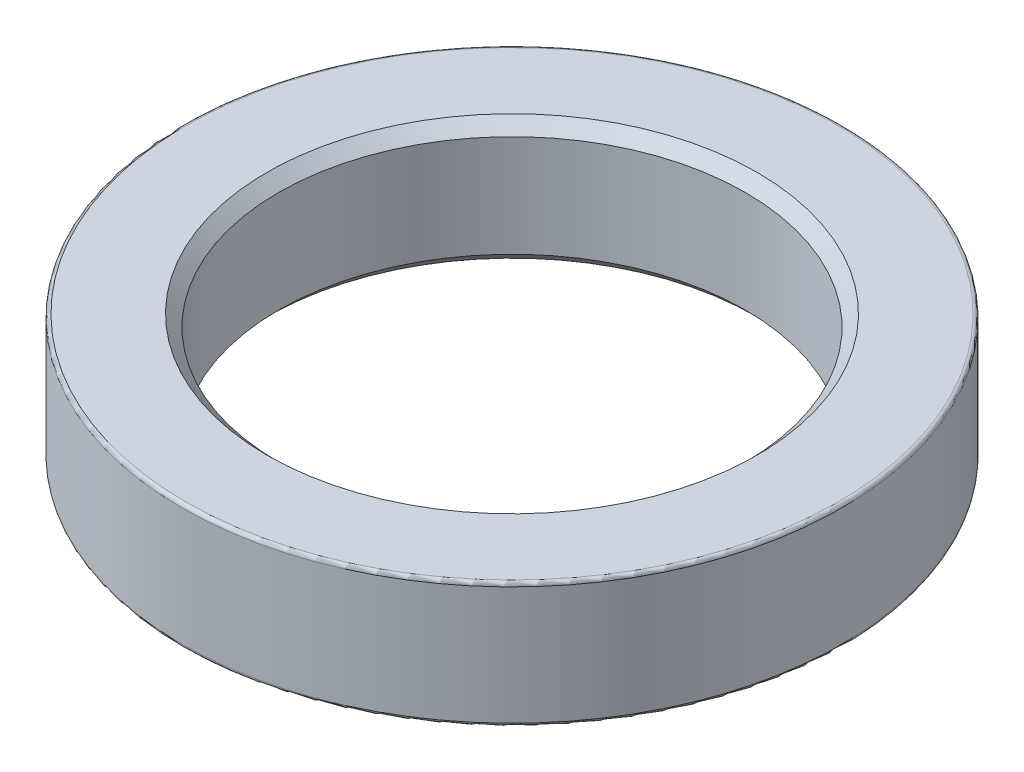
ISO-10303-21;
HEADER;
FILE_DESCRIPTION(('STEP AP214'),'2;1');
FILE_NAME('part.step','',(''),(''),'','','');
FILE_SCHEMA(('AUTOMOTIVE_DESIGN { 1 0 10303 214 1 1 1 1 }'));
ENDSEC;
DATA;
#1=APPLICATION_CONTEXT('core data for automotive mechanical design processes');
#2=APPLICATION_PROTOCOL_DEFINITION('international standard','automotive_design',2000,#1);
#3=PRODUCT_CONTEXT('',#1,'mechanical');
#4=PRODUCT('Part','Part','',(#3));
#5=PRODUCT_RELATED_PRODUCT_CATEGORY('part','',(#4));
#6=PRODUCT_DEFINITION_FORMATION('','',#4);
#7=PRODUCT_DEFINITION_CONTEXT('part definition',#1,'design');
#8=PRODUCT_DEFINITION('design','',#6,#7);
#9=PRODUCT_DEFINITION_SHAPE('','',#8);
#10=(LENGTH_UNIT() NAMED_UNIT(*) SI_UNIT(.MILLI.,.METRE.));
#11=(NAMED_UNIT(*) PLANE_ANGLE_UNIT() SI_UNIT($,.RADIAN.));
#12=(NAMED_UNIT(*) SI_UNIT($,.STERADIAN.) SOLID_ANGLE_UNIT());
#13=UNCERTAINTY_MEASURE_WITH_UNIT(LENGTH_MEASURE(1.E-05),#10,'distance_accuracy_value','');
#14=(GEOMETRIC_REPRESENTATION_CONTEXT(3) GLOBAL_UNCERTAINTY_ASSIGNED_CONTEXT((#13)) GLOBAL_UNIT_ASSIGNED_CONTEXT((#10,
#11,#12)) REPRESENTATION_CONTEXT('',''));
#15=CARTESIAN_POINT('',(0.,0.,0.));
#16=DIRECTION('',(0.,0.,1.));
#17=DIRECTION('',(1.,0.,0.));
#18=AXIS2_PLACEMENT_3D('',#15,#16,#17);
#19=CARTESIAN_POINT('',(0.,13.5128,0.));
#20=DIRECTION('',(0.,-1.,0.));
#21=DIRECTION('',(0.,0.,-1.));
#22=AXIS2_PLACEMENT_3D('',#19,#20,#21);
#23=CYLINDRICAL_SURFACE('',#22,35.5981);
#24=CARTESIAN_POINT('',(0.,0.380999999999999,0.));
#25=DIRECTION('',(0.,1.,0.));
#26=DIRECTION('',(0.,0.,1.));
#27=AXIS2_PLACEMENT_3D('',#24,#25,#26);
#28=CIRCLE('',#27,35.5981);
#29=CARTESIAN_POINT('',(0.,0.380999999999999,35.5981));
#30=VERTEX_POINT('',#29);
#31=EDGE_CURVE('E63',#30,#30,#28,.T.);
#32=ORIENTED_EDGE('',*,*,#31,.T.);
#33=EDGE_LOOP('',(#32));
#34=FACE_BOUND('',#33,.T.);
#35=CARTESIAN_POINT('',(0.,13.1318,0.));
#36=DIRECTION('',(0.,1.,0.));
#37=DIRECTION('',(0.,0.,1.));
#38=AXIS2_PLACEMENT_3D('',#35,#36,#37);
#39=CIRCLE('',#38,35.5981);
#40=CARTESIAN_POINT('',(0.,13.1318,35.5981));
#41=VERTEX_POINT('',#40);
#42=EDGE_CURVE('E66',#41,#41,#39,.F.);
#43=ORIENTED_EDGE('',*,*,#42,.T.);
#44=EDGE_LOOP('',(#43));
#45=FACE_BOUND('',#44,.T.);
#46=ADVANCED_FACE('F39',(#34,#45),#23,.T.);
#47=CARTESIAN_POINT('',(0.,13.5128,0.));
#48=DIRECTION('',(0.,1.,0.));
#49=DIRECTION('',(0.,0.,1.));
#50=AXIS2_PLACEMENT_3D('',#47,#48,#49);
#51=PLANE('',#50);
#52=CARTESIAN_POINT('',(0.,13.5128,0.));
#53=DIRECTION('',(0.,1.,0.));
#54=DIRECTION('',(0.,0.,1.));
#55=AXIS2_PLACEMENT_3D('',#52,#53,#54);
#56=CIRCLE('',#55,26.4668);
#57=CARTESIAN_POINT('',(0.,13.5128,26.4668));
#58=VERTEX_POINT('',#57);
#59=EDGE_CURVE('E51',#58,#58,#56,.F.);
#60=ORIENTED_EDGE('',*,*,#59,.T.);
#61=EDGE_LOOP('',(#60));
#62=FACE_BOUND('',#61,.T.);
#63=CARTESIAN_POINT('',(0.,13.5128,0.));
#64=DIRECTION('',(0.,1.,0.));
#65=DIRECTION('',(0.,0.,1.));
#66=AXIS2_PLACEMENT_3D('',#63,#64,#65);
#67=CIRCLE('',#66,35.2171);
#68=CARTESIAN_POINT('',(0.,13.5128,35.2171));
#69=VERTEX_POINT('',#68);
#70=EDGE_CURVE('E69',#69,#69,#67,.T.);
#71=ORIENTED_EDGE('',*,*,#70,.T.);
#72=EDGE_LOOP('',(#71));
#73=FACE_BOUND('',#72,.T.);
#74=ADVANCED_FACE('F73',(#62,#73),#51,.T.);
#75=CARTESIAN_POINT('',(0.,0.,0.));
#76=DIRECTION('',(0.,1.,0.));
#77=DIRECTION('',(0.,0.,1.));
#78=AXIS2_PLACEMENT_3D('',#75,#76,#77);
#79=PLANE('',#78);
#80=CARTESIAN_POINT('',(0.,0.,0.));
#81=DIRECTION('',(0.,1.,0.));
#82=DIRECTION('',(0.,0.,1.));
#83=AXIS2_PLACEMENT_3D('',#80,#81,#82);
#84=CIRCLE('',#83,26.4668);
#85=CARTESIAN_POINT('',(0.,0.,26.4668));
#86=VERTEX_POINT('',#85);
#87=EDGE_CURVE('E47',#86,#86,#84,.T.);
#88=ORIENTED_EDGE('',*,*,#87,.T.);
#89=EDGE_LOOP('',(#88));
#90=FACE_BOUND('',#89,.T.);
#91=CARTESIAN_POINT('',(0.,0.,0.));
#92=DIRECTION('',(0.,1.,0.));
#93=DIRECTION('',(0.,0.,1.));
#94=AXIS2_PLACEMENT_3D('',#91,#92,#93);
#95=CIRCLE('',#94,35.2171);
#96=CARTESIAN_POINT('',(0.,0.,35.2171));
#97=VERTEX_POINT('',#96);
#98=EDGE_CURVE('E60',#97,#97,#95,.F.);
#99=ORIENTED_EDGE('',*,*,#98,.T.);
#100=EDGE_LOOP('',(#99));
#101=FACE_BOUND('',#100,.T.);
#102=ADVANCED_FACE('F89',(#90,#101),#79,.F.);
#103=CARTESIAN_POINT('',(0.,-27.1272,0.));
#104=DIRECTION('',(0.,1.,0.));
#105=DIRECTION('',(0.,0.,1.));
#106=AXIS2_PLACEMENT_3D('',#103,#104,#105);
#107=CYLINDRICAL_SURFACE('',#106,25.2095);
#108=CARTESIAN_POINT('',(0.,1.25729999999998,0.));
#109=DIRECTION('',(0.,1.,0.));
#110=DIRECTION('',(0.,0.,1.));
#111=AXIS2_PLACEMENT_3D('',#108,#109,#110);
#112=CIRCLE('',#111,25.2095);
#113=CARTESIAN_POINT('',(0.,1.25729999999998,25.2095));
#114=VERTEX_POINT('',#113);
#115=EDGE_CURVE('E10',#114,#114,#112,.F.);
#116=ORIENTED_EDGE('',*,*,#115,.T.);
#117=EDGE_LOOP('',(#116));
#118=FACE_BOUND('',#117,.T.);
#119=CARTESIAN_POINT('',(0.,12.2555,0.));
#120=DIRECTION('',(0.,1.,0.));
#121=DIRECTION('',(0.,0.,1.));
#122=AXIS2_PLACEMENT_3D('',#119,#120,#121);
#123=CIRCLE('',#122,25.2095);
#124=CARTESIAN_POINT('',(0.,12.2555,25.2095));
#125=VERTEX_POINT('',#124);
#126=EDGE_CURVE('E55',#125,#125,#123,.T.);
#127=ORIENTED_EDGE('',*,*,#126,.T.);
#128=EDGE_LOOP('',(#127));
#129=FACE_BOUND('',#128,.T.);
#130=ADVANCED_FACE('F78',(#118,#129),#107,.F.);
#131=CARTESIAN_POINT('',(0.,13.1318,0.));
#132=DIRECTION('',(0.,1.,0.));
#133=DIRECTION('',(0.,0.,1.));
#134=AXIS2_PLACEMENT_3D('',#131,#132,#133);
#135=TOROIDAL_SURFACE('',#134,35.2171,0.381);
#136=ORIENTED_EDGE('',*,*,#42,.F.);
#137=EDGE_LOOP('',(#136));
#138=FACE_BOUND('',#137,.T.);
#139=ORIENTED_EDGE('',*,*,#70,.F.);
#140=EDGE_LOOP('',(#139));
#141=FACE_BOUND('',#140,.T.);
#142=ADVANCED_FACE('F75',(#138,#141),#135,.T.);
#143=CARTESIAN_POINT('',(0.,0.380999999999999,0.));
#144=DIRECTION('',(0.,1.,0.));
#145=DIRECTION('',(0.,0.,1.));
#146=AXIS2_PLACEMENT_3D('',#143,#144,#145);
#147=TOROIDAL_SURFACE('',#146,35.2171,0.381);
#148=ORIENTED_EDGE('',*,*,#98,.F.);
#149=EDGE_LOOP('',(#148));
#150=FACE_BOUND('',#149,.T.);
#151=ORIENTED_EDGE('',*,*,#31,.F.);
#152=EDGE_LOOP('',(#151));
#153=FACE_BOUND('',#152,.T.);
#154=ADVANCED_FACE('F77',(#150,#153),#147,.T.);
#155=CARTESIAN_POINT('',(0.,12.2555,0.));
#156=DIRECTION('',(0.,1.,0.));
#157=DIRECTION('',(0.,0.,1.));
#158=AXIS2_PLACEMENT_3D('',#155,#156,#157);
#159=CONICAL_SURFACE('',#158,25.2095,0.78539816339745);
#160=ORIENTED_EDGE('',*,*,#59,.F.);
#161=EDGE_LOOP('',(#160));
#162=FACE_BOUND('',#161,.T.);
#163=ORIENTED_EDGE('',*,*,#126,.F.);
#164=EDGE_LOOP('',(#163));
#165=FACE_BOUND('',#164,.T.);
#166=ADVANCED_FACE('F85',(#162,#165),#159,.F.);
#167=CARTESIAN_POINT('',(0.,0.,0.));
#168=DIRECTION('',(0.,-1.,0.));
#169=DIRECTION('',(0.,0.,-1.));
#170=AXIS2_PLACEMENT_3D('',#167,#168,#169);
#171=CONICAL_SURFACE('',#170,26.4668,0.785398163397452);
#172=ORIENTED_EDGE('',*,*,#115,.F.);
#173=EDGE_LOOP('',(#172));
#174=FACE_BOUND('',#173,.T.);
#175=ORIENTED_EDGE('',*,*,#87,.F.);
#176=EDGE_LOOP('',(#175));
#177=FACE_BOUND('',#176,.T.);
#178=ADVANCED_FACE('F42',(#174,#177),#171,.F.);
#179=CLOSED_SHELL('',(#46,#74,#102,#130,#142,#154,#166,#178));
#180=MANIFOLD_SOLID_BREP('B2',#179);
#181=ADVANCED_BREP_SHAPE_REPRESENTATION('',(#18,#180),#14);
#182=SHAPE_DEFINITION_REPRESENTATION(#9,#181);
ENDSEC;
END-ISO-10303-21;
